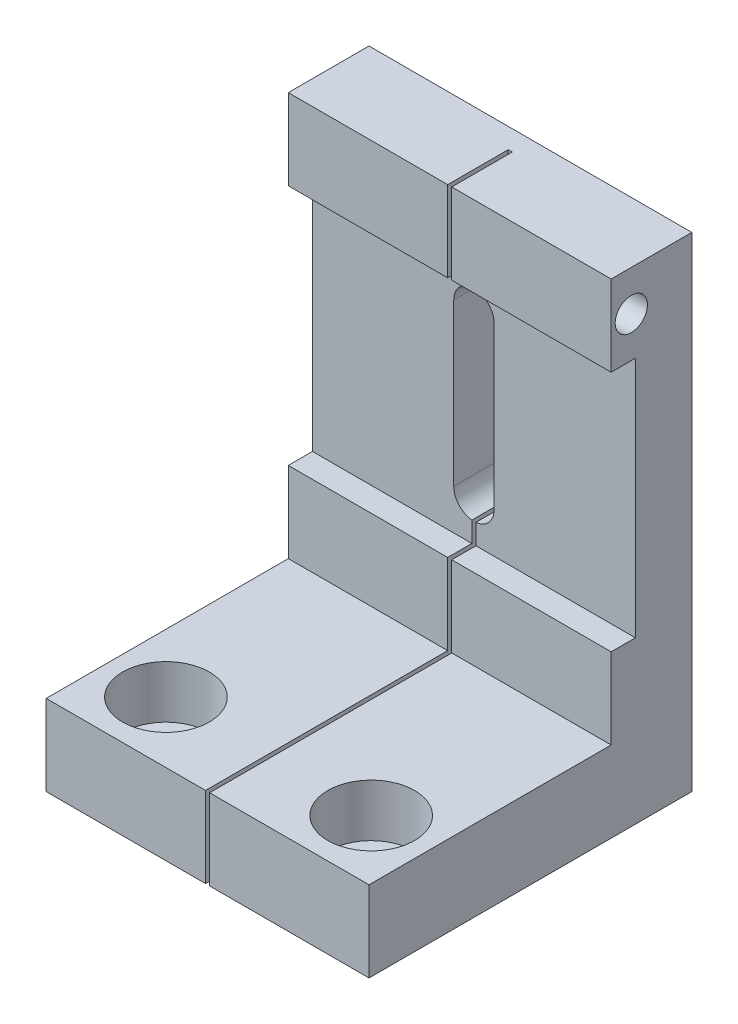
ISO-10303-21;
HEADER;
FILE_DESCRIPTION(('STEP AP214'),'2;1');
FILE_NAME('part.step','',(''),(''),'','','');
FILE_SCHEMA(('AUTOMOTIVE_DESIGN { 1 0 10303 214 1 1 1 1 }'));
ENDSEC;
DATA;
#1=APPLICATION_CONTEXT('core data for automotive mechanical design processes');
#2=APPLICATION_PROTOCOL_DEFINITION('international standard','automotive_design',2000,#1);
#3=PRODUCT_CONTEXT('',#1,'mechanical');
#4=PRODUCT('Part','Part','',(#3));
#5=PRODUCT_RELATED_PRODUCT_CATEGORY('part','',(#4));
#6=PRODUCT_DEFINITION_FORMATION('','',#4);
#7=PRODUCT_DEFINITION_CONTEXT('part definition',#1,'design');
#8=PRODUCT_DEFINITION('design','',#6,#7);
#9=PRODUCT_DEFINITION_SHAPE('','',#8);
#10=(LENGTH_UNIT() NAMED_UNIT(*) SI_UNIT(.MILLI.,.METRE.));
#11=(NAMED_UNIT(*) PLANE_ANGLE_UNIT() SI_UNIT($,.RADIAN.));
#12=(NAMED_UNIT(*) SI_UNIT($,.STERADIAN.) SOLID_ANGLE_UNIT());
#13=UNCERTAINTY_MEASURE_WITH_UNIT(LENGTH_MEASURE(1.E-05),#10,'distance_accuracy_value','');
#14=(GEOMETRIC_REPRESENTATION_CONTEXT(3) GLOBAL_UNCERTAINTY_ASSIGNED_CONTEXT((#13)) GLOBAL_UNIT_ASSIGNED_CONTEXT((#10,
#11,#12)) REPRESENTATION_CONTEXT('',''));
#15=CARTESIAN_POINT('',(0.,0.,0.));
#16=DIRECTION('',(0.,0.,1.));
#17=DIRECTION('',(1.,0.,0.));
#18=AXIS2_PLACEMENT_3D('',#15,#16,#17);
#19=CARTESIAN_POINT('',(-7.29999999999999,-40.383347775863,32.43));
#20=DIRECTION('',(0.,-1.,0.));
#21=DIRECTION('',(0.,0.,-1.));
#22=AXIS2_PLACEMENT_3D('',#19,#20,#21);
#23=CYLINDRICAL_SURFACE('',#22,3.4);
#24=CARTESIAN_POINT('',(-7.29999999999999,-60.,32.43));
#25=DIRECTION('',(0.,-1.,0.));
#26=DIRECTION('',(0.,0.,-1.));
#27=AXIS2_PLACEMENT_3D('',#24,#25,#26);
#28=CIRCLE('',#27,3.4);
#29=CARTESIAN_POINT('',(-7.29999999999999,-60.,29.03));
#30=VERTEX_POINT('',#29);
#31=EDGE_CURVE('E471',#30,#30,#28,.T.);
#32=ORIENTED_EDGE('',*,*,#31,.T.);
#33=EDGE_LOOP('',(#32));
#34=FACE_BOUND('',#33,.T.);
#35=CARTESIAN_POINT('',(-7.29999999999999,-56.5,32.43));
#36=DIRECTION('',(0.,1.,0.));
#37=DIRECTION('',(-1.,0.,0.));
#38=AXIS2_PLACEMENT_3D('',#35,#36,#37);
#39=CIRCLE('',#38,3.4);
#40=CARTESIAN_POINT('',(-10.7,-56.5,32.43));
#41=VERTEX_POINT('',#40);
#42=EDGE_CURVE('E41',#41,#41,#39,.F.);
#43=ORIENTED_EDGE('',*,*,#42,.F.);
#44=EDGE_LOOP('',(#43));
#45=FACE_BOUND('',#44,.T.);
#46=ADVANCED_FACE('F37',(#34,#45),#23,.F.);
#47=CARTESIAN_POINT('',(-32.73,-40.383347775863,32.43));
#48=DIRECTION('',(0.,-1.,0.));
#49=DIRECTION('',(0.,0.,-1.));
#50=AXIS2_PLACEMENT_3D('',#47,#48,#49);
#51=CYLINDRICAL_SURFACE('',#50,3.4);
#52=CARTESIAN_POINT('',(-32.73,-60.,32.43));
#53=DIRECTION('',(0.,-1.,0.));
#54=DIRECTION('',(0.,0.,-1.));
#55=AXIS2_PLACEMENT_3D('',#52,#53,#54);
#56=CIRCLE('',#55,3.4);
#57=CARTESIAN_POINT('',(-32.73,-60.,29.03));
#58=VERTEX_POINT('',#57);
#59=EDGE_CURVE('E462',#58,#58,#56,.T.);
#60=ORIENTED_EDGE('',*,*,#59,.T.);
#61=EDGE_LOOP('',(#60));
#62=FACE_BOUND('',#61,.T.);
#63=CARTESIAN_POINT('',(-32.73,-56.5,32.43));
#64=DIRECTION('',(0.,1.,0.));
#65=DIRECTION('',(-1.,0.,0.));
#66=AXIS2_PLACEMENT_3D('',#63,#64,#65);
#67=CIRCLE('',#66,3.4);
#68=CARTESIAN_POINT('',(-36.13,-56.5,32.43));
#69=VERTEX_POINT('',#68);
#70=EDGE_CURVE('E440',#69,#69,#67,.F.);
#71=ORIENTED_EDGE('',*,*,#70,.F.);
#72=EDGE_LOOP('',(#71));
#73=FACE_BOUND('',#72,.T.);
#74=ADVANCED_FACE('F585',(#62,#73),#51,.F.);
#75=CARTESIAN_POINT('',(0.,0.,10.));
#76=DIRECTION('',(0.,0.,-1.));
#77=DIRECTION('',(-1.,0.,0.));
#78=AXIS2_PLACEMENT_3D('',#75,#76,#77);
#79=PLANE('',#78);
#80=DIRECTION('',(1.,0.,0.));
#81=VECTOR('',#80,1.);
#82=CARTESIAN_POINT('',(-40.,-40.,10.));
#83=LINE('',#82,#81);
#84=CARTESIAN_POINT('',(-19.75,-40.,10.));
#85=VERTEX_POINT('',#84);
#86=CARTESIAN_POINT('',(0.,-40.,10.));
#87=VERTEX_POINT('',#86);
#88=EDGE_CURVE('E345',#85,#87,#83,.T.);
#89=ORIENTED_EDGE('',*,*,#88,.F.);
#90=DIRECTION('',(0.,-1.,0.));
#91=VECTOR('',#90,1.);
#92=CARTESIAN_POINT('',(-19.75,0.,10.));
#93=LINE('',#92,#91);
#94=CARTESIAN_POINT('',(-19.75,-50.,10.));
#95=VERTEX_POINT('',#94);
#96=EDGE_CURVE('E290',#85,#95,#93,.T.);
#97=ORIENTED_EDGE('',*,*,#96,.T.);
#98=DIRECTION('',(-1.,0.,0.));
#99=VECTOR('',#98,1.);
#100=CARTESIAN_POINT('',(0.,-50.,10.));
#101=LINE('',#100,#99);
#102=CARTESIAN_POINT('',(0.,-50.,10.));
#103=VERTEX_POINT('',#102);
#104=EDGE_CURVE('E315',#103,#95,#101,.T.);
#105=ORIENTED_EDGE('',*,*,#104,.F.);
#106=DIRECTION('',(0.,1.,0.));
#107=VECTOR('',#106,1.);
#108=CARTESIAN_POINT('',(0.,0.,10.));
#109=LINE('',#108,#107);
#110=EDGE_CURVE('E404',#103,#87,#109,.T.);
#111=ORIENTED_EDGE('',*,*,#110,.T.);
#112=EDGE_LOOP('',(#89,#97,#105,#111));
#113=FACE_BOUND('',#112,.T.);
#114=ADVANCED_FACE('F505',(#113),#79,.F.);
#115=DIRECTION('',(-1.,0.,0.));
#116=VECTOR('',#115,1.);
#117=CARTESIAN_POINT('',(0.,0.,10.));
#118=LINE('',#117,#116);
#119=CARTESIAN_POINT('',(0.,0.,10.));
#120=VERTEX_POINT('',#119);
#121=CARTESIAN_POINT('',(-19.75,0.,10.));
#122=VERTEX_POINT('',#121);
#123=EDGE_CURVE('E409',#120,#122,#118,.T.);
#124=ORIENTED_EDGE('',*,*,#123,.T.);
#125=DIRECTION('',(0.,-1.,0.));
#126=VECTOR('',#125,1.);
#127=CARTESIAN_POINT('',(-19.75,0.,10.));
#128=LINE('',#127,#126);
#129=CARTESIAN_POINT('',(-19.75,-10.,10.));
#130=VERTEX_POINT('',#129);
#131=EDGE_CURVE('E230',#122,#130,#128,.T.);
#132=ORIENTED_EDGE('',*,*,#131,.T.);
#133=DIRECTION('',(1.,0.,0.));
#134=VECTOR('',#133,1.);
#135=CARTESIAN_POINT('',(-40.,-10.,10.));
#136=LINE('',#135,#134);
#137=CARTESIAN_POINT('',(0.,-10.,10.));
#138=VERTEX_POINT('',#137);
#139=EDGE_CURVE('E357',#130,#138,#136,.T.);
#140=ORIENTED_EDGE('',*,*,#139,.T.);
#141=EDGE_CURVE('E408',#138,#120,#109,.T.);
#142=ORIENTED_EDGE('',*,*,#141,.T.);
#143=EDGE_LOOP('',(#124,#132,#140,#142));
#144=FACE_BOUND('',#143,.T.);
#145=ADVANCED_FACE('F538',(#144),#79,.F.);
#146=CARTESIAN_POINT('',(-40.,-10.,7.));
#147=DIRECTION('',(0.,0.,-1.));
#148=DIRECTION('',(0.,1.,0.));
#149=AXIS2_PLACEMENT_3D('',#146,#147,#148);
#150=PLANE('',#149);
#151=DIRECTION('',(1.,0.,0.));
#152=VECTOR('',#151,1.);
#153=CARTESIAN_POINT('',(-40.,-10.,7.));
#154=LINE('',#153,#152);
#155=CARTESIAN_POINT('',(-19.75,-10.,7.));
#156=VERTEX_POINT('',#155);
#157=CARTESIAN_POINT('',(0.,-10.,7.));
#158=VERTEX_POINT('',#157);
#159=EDGE_CURVE('E361',#156,#158,#154,.T.);
#160=ORIENTED_EDGE('',*,*,#159,.F.);
#161=DIRECTION('',(0.,-1.,0.));
#162=VECTOR('',#161,1.);
#163=CARTESIAN_POINT('',(-19.75,-10.,7.));
#164=LINE('',#163,#162);
#165=CARTESIAN_POINT('',(-19.75,-12.5125314072334,7.));
#166=VERTEX_POINT('',#165);
#167=EDGE_CURVE('E300',#156,#166,#164,.T.);
#168=ORIENTED_EDGE('',*,*,#167,.T.);
#169=CARTESIAN_POINT('',(-20.,-15.,7.));
#170=DIRECTION('',(0.,0.,-1.));
#171=DIRECTION('',(0.,1.,0.));
#172=AXIS2_PLACEMENT_3D('',#169,#170,#171);
#173=CIRCLE('',#172,2.5);
#174=CARTESIAN_POINT('',(-17.5,-15.,7.));
#175=VERTEX_POINT('',#174);
#176=EDGE_CURVE('E376',#175,#166,#173,.F.);
#177=ORIENTED_EDGE('',*,*,#176,.F.);
#178=DIRECTION('',(0.,1.,0.));
#179=VECTOR('',#178,1.);
#180=CARTESIAN_POINT('',(-17.5,-15.,7.));
#181=LINE('',#180,#179);
#182=CARTESIAN_POINT('',(-17.5,-35.,7.));
#183=VERTEX_POINT('',#182);
#184=EDGE_CURVE('E372',#183,#175,#181,.T.);
#185=ORIENTED_EDGE('',*,*,#184,.F.);
#186=CARTESIAN_POINT('',(-20.,-35.,7.));
#187=DIRECTION('',(0.,0.,-1.));
#188=DIRECTION('',(0.,1.,0.));
#189=AXIS2_PLACEMENT_3D('',#186,#187,#188);
#190=CIRCLE('',#189,2.5);
#191=CARTESIAN_POINT('',(-19.75,-37.4874685927665,7.));
#192=VERTEX_POINT('',#191);
#193=EDGE_CURVE('E356',#192,#183,#190,.F.);
#194=ORIENTED_EDGE('',*,*,#193,.F.);
#195=CARTESIAN_POINT('',(-19.75,-40.,7.));
#196=VERTEX_POINT('',#195);
#197=EDGE_CURVE('E296',#192,#196,#164,.T.);
#198=ORIENTED_EDGE('',*,*,#197,.T.);
#199=DIRECTION('',(1.,0.,0.));
#200=VECTOR('',#199,1.);
#201=CARTESIAN_POINT('',(-40.,-40.,7.));
#202=LINE('',#201,#200);
#203=CARTESIAN_POINT('',(0.,-40.,7.));
#204=VERTEX_POINT('',#203);
#205=EDGE_CURVE('E365',#196,#204,#202,.T.);
#206=ORIENTED_EDGE('',*,*,#205,.T.);
#207=DIRECTION('',(0.,1.,0.));
#208=VECTOR('',#207,1.);
#209=CARTESIAN_POINT('',(0.,-10.,7.));
#210=LINE('',#209,#208);
#211=EDGE_CURVE('E348',#204,#158,#210,.T.);
#212=ORIENTED_EDGE('',*,*,#211,.T.);
#213=EDGE_LOOP('',(#160,#168,#177,#185,#194,#198,#206,#212));
#214=FACE_BOUND('',#213,.T.);
#215=ADVANCED_FACE('F513',(#214),#150,.F.);
#216=CARTESIAN_POINT('',(-40.,-10.,7.));
#217=DIRECTION('',(0.,1.,0.));
#218=DIRECTION('',(-1.,0.,0.));
#219=AXIS2_PLACEMENT_3D('',#216,#217,#218);
#220=PLANE('',#219);
#221=ORIENTED_EDGE('',*,*,#139,.F.);
#222=DIRECTION('',(0.,0.,-1.));
#223=VECTOR('',#222,1.);
#224=CARTESIAN_POINT('',(-19.75,-10.,7.));
#225=LINE('',#224,#223);
#226=EDGE_CURVE('E303',#130,#156,#225,.T.);
#227=ORIENTED_EDGE('',*,*,#226,.T.);
#228=ORIENTED_EDGE('',*,*,#159,.T.);
#229=DIRECTION('',(0.,0.,1.));
#230=VECTOR('',#229,1.);
#231=CARTESIAN_POINT('',(0.,-10.,7.));
#232=LINE('',#231,#230);
#233=EDGE_CURVE('E339',#158,#138,#232,.T.);
#234=ORIENTED_EDGE('',*,*,#233,.T.);
#235=EDGE_LOOP('',(#221,#227,#228,#234));
#236=FACE_BOUND('',#235,.T.);
#237=ADVANCED_FACE('F541',(#236),#220,.F.);
#238=CARTESIAN_POINT('',(-40.,-40.,7.));
#239=DIRECTION('',(0.,-1.,0.));
#240=DIRECTION('',(1.,0.,0.));
#241=AXIS2_PLACEMENT_3D('',#238,#239,#240);
#242=PLANE('',#241);
#243=ORIENTED_EDGE('',*,*,#205,.F.);
#244=DIRECTION('',(0.,0.,1.));
#245=VECTOR('',#244,1.);
#246=CARTESIAN_POINT('',(-19.75,-40.,7.));
#247=LINE('',#246,#245);
#248=EDGE_CURVE('E293',#196,#85,#247,.T.);
#249=ORIENTED_EDGE('',*,*,#248,.T.);
#250=ORIENTED_EDGE('',*,*,#88,.T.);
#251=DIRECTION('',(0.,0.,-1.));
#252=VECTOR('',#251,1.);
#253=CARTESIAN_POINT('',(0.,-40.,7.));
#254=LINE('',#253,#252);
#255=EDGE_CURVE('E334',#87,#204,#254,.T.);
#256=ORIENTED_EDGE('',*,*,#255,.T.);
#257=EDGE_LOOP('',(#243,#249,#250,#256));
#258=FACE_BOUND('',#257,.T.);
#259=ADVANCED_FACE('F508',(#258),#242,.F.);
#260=CARTESIAN_POINT('',(0.,-50.,40.));
#261=DIRECTION('',(0.,-1.,0.));
#262=DIRECTION('',(1.,0.,0.));
#263=AXIS2_PLACEMENT_3D('',#260,#261,#262);
#264=PLANE('',#263);
#265=CARTESIAN_POINT('',(-7.29999999999999,-50.,32.43));
#266=DIRECTION('',(0.,1.,0.));
#267=DIRECTION('',(-1.,0.,0.));
#268=AXIS2_PLACEMENT_3D('',#265,#266,#267);
#269=CIRCLE('',#268,5.375);
#270=CARTESIAN_POINT('',(-12.675,-50.,32.43));
#271=VERTEX_POINT('',#270);
#272=EDGE_CURVE('E457',#271,#271,#269,.T.);
#273=ORIENTED_EDGE('',*,*,#272,.F.);
#274=EDGE_LOOP('',(#273));
#275=FACE_BOUND('',#274,.T.);
#276=ORIENTED_EDGE('',*,*,#104,.T.);
#277=DIRECTION('',(0.,0.,1.));
#278=VECTOR('',#277,1.);
#279=CARTESIAN_POINT('',(-19.75,-50.,40.));
#280=LINE('',#279,#278);
#281=CARTESIAN_POINT('',(-19.75,-50.,40.));
#282=VERTEX_POINT('',#281);
#283=EDGE_CURVE('E287',#95,#282,#280,.T.);
#284=ORIENTED_EDGE('',*,*,#283,.T.);
#285=DIRECTION('',(-1.,0.,0.));
#286=VECTOR('',#285,1.);
#287=CARTESIAN_POINT('',(0.,-50.,40.));
#288=LINE('',#287,#286);
#289=CARTESIAN_POINT('',(0.,-50.,40.));
#290=VERTEX_POINT('',#289);
#291=EDGE_CURVE('E316',#290,#282,#288,.T.);
#292=ORIENTED_EDGE('',*,*,#291,.F.);
#293=DIRECTION('',(0.,0.,-1.));
#294=VECTOR('',#293,1.);
#295=CARTESIAN_POINT('',(0.,-50.,40.));
#296=LINE('',#295,#294);
#297=EDGE_CURVE('E331',#290,#103,#296,.T.);
#298=ORIENTED_EDGE('',*,*,#297,.T.);
#299=EDGE_LOOP('',(#276,#284,#292,#298));
#300=FACE_BOUND('',#299,.T.);
#301=ADVANCED_FACE('F502',(#275,#300),#264,.F.);
#302=CARTESIAN_POINT('',(0.,0.,40.));
#303=DIRECTION('',(0.,0.,1.));
#304=DIRECTION('',(1.,0.,0.));
#305=AXIS2_PLACEMENT_3D('',#302,#303,#304);
#306=PLANE('',#305);
#307=DIRECTION('',(0.,1.,0.));
#308=VECTOR('',#307,1.);
#309=CARTESIAN_POINT('',(-19.75,-97.5033331851984,40.));
#310=LINE('',#309,#308);
#311=CARTESIAN_POINT('',(-19.75,-60.,40.));
#312=VERTEX_POINT('',#311);
#313=EDGE_CURVE('E254',#312,#282,#310,.T.);
#314=ORIENTED_EDGE('',*,*,#313,.F.);
#315=DIRECTION('',(1.,0.,0.));
#316=VECTOR('',#315,1.);
#317=CARTESIAN_POINT('',(0.,-60.,40.));
#318=LINE('',#317,#316);
#319=CARTESIAN_POINT('',(0.,-60.,40.));
#320=VERTEX_POINT('',#319);
#321=EDGE_CURVE('E322',#312,#320,#318,.T.);
#322=ORIENTED_EDGE('',*,*,#321,.T.);
#323=DIRECTION('',(0.,1.,0.));
#324=VECTOR('',#323,1.);
#325=CARTESIAN_POINT('',(0.,-60.,40.));
#326=LINE('',#325,#324);
#327=EDGE_CURVE('E311',#320,#290,#326,.T.);
#328=ORIENTED_EDGE('',*,*,#327,.T.);
#329=ORIENTED_EDGE('',*,*,#291,.T.);
#330=EDGE_LOOP('',(#314,#322,#328,#329));
#331=FACE_BOUND('',#330,.T.);
#332=ADVANCED_FACE('F490',(#331),#306,.T.);
#333=CARTESIAN_POINT('',(-20.25,-50.,10.));
#334=VERTEX_POINT('',#333);
#335=CARTESIAN_POINT('',(-40.,-50.,10.));
#336=VERTEX_POINT('',#335);
#337=EDGE_CURVE('E310',#334,#336,#101,.T.);
#338=ORIENTED_EDGE('',*,*,#337,.F.);
#339=DIRECTION('',(0.,1.,0.));
#340=VECTOR('',#339,1.);
#341=CARTESIAN_POINT('',(-20.25,0.,10.));
#342=LINE('',#341,#340);
#343=CARTESIAN_POINT('',(-20.25,-40.,10.));
#344=VERTEX_POINT('',#343);
#345=EDGE_CURVE('E268',#334,#344,#342,.T.);
#346=ORIENTED_EDGE('',*,*,#345,.T.);
#347=CARTESIAN_POINT('',(-40.,-40.,10.));
#348=VERTEX_POINT('',#347);
#349=EDGE_CURVE('E366',#348,#344,#83,.T.);
#350=ORIENTED_EDGE('',*,*,#349,.F.);
#351=DIRECTION('',(0.,-1.,0.));
#352=VECTOR('',#351,1.);
#353=CARTESIAN_POINT('',(-40.,0.,10.));
#354=LINE('',#353,#352);
#355=EDGE_CURVE('E411',#348,#336,#354,.T.);
#356=ORIENTED_EDGE('',*,*,#355,.T.);
#357=EDGE_LOOP('',(#338,#346,#350,#356));
#358=FACE_BOUND('',#357,.T.);
#359=ADVANCED_FACE('F567',(#358),#79,.F.);
#360=CARTESIAN_POINT('',(-40.,-10.,10.));
#361=VERTEX_POINT('',#360);
#362=CARTESIAN_POINT('',(-20.25,-10.,10.));
#363=VERTEX_POINT('',#362);
#364=EDGE_CURVE('E353',#361,#363,#136,.T.);
#365=ORIENTED_EDGE('',*,*,#364,.T.);
#366=DIRECTION('',(0.,1.,0.));
#367=VECTOR('',#366,1.);
#368=CARTESIAN_POINT('',(-20.25,0.,10.));
#369=LINE('',#368,#367);
#370=CARTESIAN_POINT('',(-20.25,0.,10.));
#371=VERTEX_POINT('',#370);
#372=EDGE_CURVE('E54',#363,#371,#369,.T.);
#373=ORIENTED_EDGE('',*,*,#372,.T.);
#374=CARTESIAN_POINT('',(-40.,0.,10.));
#375=VERTEX_POINT('',#374);
#376=EDGE_CURVE('E407',#371,#375,#118,.T.);
#377=ORIENTED_EDGE('',*,*,#376,.T.);
#378=EDGE_CURVE('E412',#375,#361,#354,.T.);
#379=ORIENTED_EDGE('',*,*,#378,.T.);
#380=EDGE_LOOP('',(#365,#373,#377,#379));
#381=FACE_BOUND('',#380,.T.);
#382=ADVANCED_FACE('F639',(#381),#79,.F.);
#383=CARTESIAN_POINT('',(0.,0.,10.));
#384=DIRECTION('',(-1.,0.,0.));
#385=DIRECTION('',(0.,-1.,0.));
#386=AXIS2_PLACEMENT_3D('',#383,#384,#385);
#387=PLANE('',#386);
#388=CARTESIAN_POINT('',(0.,-5.,7.5));
#389=DIRECTION('',(1.,0.,0.));
#390=DIRECTION('',(0.,1.,0.));
#391=AXIS2_PLACEMENT_3D('',#388,#389,#390);
#392=CIRCLE('',#391,2.);
#393=CARTESIAN_POINT('',(0.,-3.,7.5));
#394=VERTEX_POINT('',#393);
#395=EDGE_CURVE('E474',#394,#394,#392,.T.);
#396=ORIENTED_EDGE('',*,*,#395,.F.);
#397=EDGE_LOOP('',(#396));
#398=FACE_BOUND('',#397,.T.);
#399=ORIENTED_EDGE('',*,*,#141,.F.);
#400=ORIENTED_EDGE('',*,*,#233,.F.);
#401=ORIENTED_EDGE('',*,*,#211,.F.);
#402=ORIENTED_EDGE('',*,*,#255,.F.);
#403=ORIENTED_EDGE('',*,*,#110,.F.);
#404=ORIENTED_EDGE('',*,*,#297,.F.);
#405=ORIENTED_EDGE('',*,*,#327,.F.);
#406=DIRECTION('',(0.,0.,-1.));
#407=VECTOR('',#406,1.);
#408=CARTESIAN_POINT('',(0.,-60.,10.));
#409=LINE('',#408,#407);
#410=CARTESIAN_POINT('',(0.,-60.,0.));
#411=VERTEX_POINT('',#410);
#412=EDGE_CURVE('E415',#320,#411,#409,.T.);
#413=ORIENTED_EDGE('',*,*,#412,.T.);
#414=DIRECTION('',(0.,1.,0.));
#415=VECTOR('',#414,1.);
#416=CARTESIAN_POINT('',(0.,0.,0.));
#417=LINE('',#416,#415);
#418=CARTESIAN_POINT('',(0.,0.,0.));
#419=VERTEX_POINT('',#418);
#420=EDGE_CURVE('E395',#411,#419,#417,.T.);
#421=ORIENTED_EDGE('',*,*,#420,.T.);
#422=DIRECTION('',(0.,0.,-1.));
#423=VECTOR('',#422,1.);
#424=CARTESIAN_POINT('',(0.,0.,10.));
#425=LINE('',#424,#423);
#426=EDGE_CURVE('E432',#120,#419,#425,.T.);
#427=ORIENTED_EDGE('',*,*,#426,.F.);
#428=EDGE_LOOP('',(#399,#400,#401,#402,#403,#404,#405,#413,#421,#427));
#429=FACE_BOUND('',#428,.T.);
#430=ADVANCED_FACE('F39',(#398,#429),#387,.F.);
#431=CARTESIAN_POINT('',(0.,0.,10.));
#432=DIRECTION('',(0.,-1.,0.));
#433=DIRECTION('',(1.,0.,0.));
#434=AXIS2_PLACEMENT_3D('',#431,#432,#433);
#435=PLANE('',#434);
#436=DIRECTION('',(-1.,0.,0.));
#437=VECTOR('',#436,1.);
#438=CARTESIAN_POINT('',(-20.25,0.,2.5));
#439=LINE('',#438,#437);
#440=CARTESIAN_POINT('',(-19.75,0.,2.5));
#441=VERTEX_POINT('',#440);
#442=CARTESIAN_POINT('',(-20.25,0.,2.5));
#443=VERTEX_POINT('',#442);
#444=EDGE_CURVE('E235',#441,#443,#439,.T.);
#445=ORIENTED_EDGE('',*,*,#444,.F.);
#446=DIRECTION('',(0.,0.,-1.));
#447=VECTOR('',#446,1.);
#448=CARTESIAN_POINT('',(-19.75,0.,40.));
#449=LINE('',#448,#447);
#450=EDGE_CURVE('E224',#122,#441,#449,.T.);
#451=ORIENTED_EDGE('',*,*,#450,.F.);
#452=ORIENTED_EDGE('',*,*,#123,.F.);
#453=ORIENTED_EDGE('',*,*,#426,.T.);
#454=DIRECTION('',(-1.,0.,0.));
#455=VECTOR('',#454,1.);
#456=CARTESIAN_POINT('',(0.,0.,0.));
#457=LINE('',#456,#455);
#458=CARTESIAN_POINT('',(-40.,0.,0.));
#459=VERTEX_POINT('',#458);
#460=EDGE_CURVE('E418',#419,#459,#457,.T.);
#461=ORIENTED_EDGE('',*,*,#460,.T.);
#462=DIRECTION('',(0.,0.,-1.));
#463=VECTOR('',#462,1.);
#464=CARTESIAN_POINT('',(-40.,0.,10.));
#465=LINE('',#464,#463);
#466=EDGE_CURVE('E429',#375,#459,#465,.T.);
#467=ORIENTED_EDGE('',*,*,#466,.F.);
#468=ORIENTED_EDGE('',*,*,#376,.F.);
#469=DIRECTION('',(0.,0.,1.));
#470=VECTOR('',#469,1.);
#471=CARTESIAN_POINT('',(-20.25,0.,40.));
#472=LINE('',#471,#470);
#473=EDGE_CURVE('E246',#443,#371,#472,.T.);
#474=ORIENTED_EDGE('',*,*,#473,.F.);
#475=EDGE_LOOP('',(#445,#451,#452,#453,#461,#467,#468,#474));
#476=FACE_BOUND('',#475,.T.);
#477=ADVANCED_FACE('F248',(#476),#435,.F.);
#478=CARTESIAN_POINT('',(-40.,0.,10.));
#479=DIRECTION('',(1.,0.,0.));
#480=DIRECTION('',(0.,1.,0.));
#481=AXIS2_PLACEMENT_3D('',#478,#479,#480);
#482=PLANE('',#481);
#483=DIRECTION('',(0.,1.,0.));
#484=VECTOR('',#483,1.);
#485=CARTESIAN_POINT('',(-40.,-10.,7.));
#486=LINE('',#485,#484);
#487=CARTESIAN_POINT('',(-40.,-40.,7.));
#488=VERTEX_POINT('',#487);
#489=CARTESIAN_POINT('',(-40.,-10.,7.));
#490=VERTEX_POINT('',#489);
#491=EDGE_CURVE('E338',#488,#490,#486,.T.);
#492=ORIENTED_EDGE('',*,*,#491,.T.);
#493=DIRECTION('',(0.,0.,1.));
#494=VECTOR('',#493,1.);
#495=CARTESIAN_POINT('',(-40.,-10.,7.));
#496=LINE('',#495,#494);
#497=EDGE_CURVE('E342',#490,#361,#496,.T.);
#498=ORIENTED_EDGE('',*,*,#497,.T.);
#499=ORIENTED_EDGE('',*,*,#378,.F.);
#500=ORIENTED_EDGE('',*,*,#466,.T.);
#501=DIRECTION('',(0.,-1.,0.));
#502=VECTOR('',#501,1.);
#503=CARTESIAN_POINT('',(-40.,0.,0.));
#504=LINE('',#503,#502);
#505=CARTESIAN_POINT('',(-40.,-60.,0.));
#506=VERTEX_POINT('',#505);
#507=EDGE_CURVE('E420',#459,#506,#504,.T.);
#508=ORIENTED_EDGE('',*,*,#507,.T.);
#509=DIRECTION('',(0.,0.,-1.));
#510=VECTOR('',#509,1.);
#511=CARTESIAN_POINT('',(-40.,-60.,10.));
#512=LINE('',#511,#510);
#513=CARTESIAN_POINT('',(-40.,-60.,40.));
#514=VERTEX_POINT('',#513);
#515=EDGE_CURVE('E426',#514,#506,#512,.T.);
#516=ORIENTED_EDGE('',*,*,#515,.F.);
#517=DIRECTION('',(0.,-1.,0.));
#518=VECTOR('',#517,1.);
#519=CARTESIAN_POINT('',(-40.,-60.,40.));
#520=LINE('',#519,#518);
#521=CARTESIAN_POINT('',(-40.,-50.,40.));
#522=VERTEX_POINT('',#521);
#523=EDGE_CURVE('E319',#522,#514,#520,.T.);
#524=ORIENTED_EDGE('',*,*,#523,.F.);
#525=DIRECTION('',(0.,0.,-1.));
#526=VECTOR('',#525,1.);
#527=CARTESIAN_POINT('',(-40.,-50.,40.));
#528=LINE('',#527,#526);
#529=EDGE_CURVE('E326',#522,#336,#528,.T.);
#530=ORIENTED_EDGE('',*,*,#529,.T.);
#531=ORIENTED_EDGE('',*,*,#355,.F.);
#532=DIRECTION('',(0.,0.,-1.));
#533=VECTOR('',#532,1.);
#534=CARTESIAN_POINT('',(-40.,-40.,7.));
#535=LINE('',#534,#533);
#536=EDGE_CURVE('E335',#348,#488,#535,.T.);
#537=ORIENTED_EDGE('',*,*,#536,.T.);
#538=EDGE_LOOP('',(#492,#498,#499,#500,#508,#516,#524,#530,#531,#537));
#539=FACE_BOUND('',#538,.T.);
#540=ADVANCED_FACE('F529',(#539),#482,.F.);
#541=CARTESIAN_POINT('',(0.,-60.,10.));
#542=DIRECTION('',(0.,1.,0.));
#543=DIRECTION('',(0.,0.,1.));
#544=AXIS2_PLACEMENT_3D('',#541,#542,#543);
#545=PLANE('',#544);
#546=CARTESIAN_POINT('',(-7.3,-60.,6.99999999999999));
#547=DIRECTION('',(0.,-1.,0.));
#548=DIRECTION('',(0.,0.,-1.));
#549=AXIS2_PLACEMENT_3D('',#546,#547,#548);
#550=CIRCLE('',#549,2.49);
#551=CARTESIAN_POINT('',(-7.3,-60.,4.50999999999999));
#552=VERTEX_POINT('',#551);
#553=EDGE_CURVE('E442',#552,#552,#550,.T.);
#554=ORIENTED_EDGE('',*,*,#553,.F.);
#555=EDGE_LOOP('',(#554));
#556=FACE_BOUND('',#555,.T.);
#557=ORIENTED_EDGE('',*,*,#59,.F.);
#558=EDGE_LOOP('',(#557));
#559=FACE_BOUND('',#558,.T.);
#560=CARTESIAN_POINT('',(-32.73,-60.,7.));
#561=DIRECTION('',(0.,-1.,0.));
#562=DIRECTION('',(0.,0.,-1.));
#563=AXIS2_PLACEMENT_3D('',#560,#561,#562);
#564=CIRCLE('',#563,2.49);
#565=CARTESIAN_POINT('',(-32.73,-60.,4.51));
#566=VERTEX_POINT('',#565);
#567=EDGE_CURVE('E465',#566,#566,#564,.T.);
#568=ORIENTED_EDGE('',*,*,#567,.F.);
#569=EDGE_LOOP('',(#568));
#570=FACE_BOUND('',#569,.T.);
#571=ORIENTED_EDGE('',*,*,#31,.F.);
#572=EDGE_LOOP('',(#571));
#573=FACE_BOUND('',#572,.T.);
#574=ORIENTED_EDGE('',*,*,#321,.F.);
#575=DIRECTION('',(0.,0.,1.));
#576=VECTOR('',#575,1.);
#577=CARTESIAN_POINT('',(-19.75,-60.,40.));
#578=LINE('',#577,#576);
#579=CARTESIAN_POINT('',(-19.75,-60.,2.5));
#580=VERTEX_POINT('',#579);
#581=EDGE_CURVE('E266',#580,#312,#578,.T.);
#582=ORIENTED_EDGE('',*,*,#581,.F.);
#583=DIRECTION('',(1.,0.,0.));
#584=VECTOR('',#583,1.);
#585=CARTESIAN_POINT('',(-20.25,-60.,2.5));
#586=LINE('',#585,#584);
#587=CARTESIAN_POINT('',(-20.25,-60.,2.5));
#588=VERTEX_POINT('',#587);
#589=EDGE_CURVE('E264',#588,#580,#586,.T.);
#590=ORIENTED_EDGE('',*,*,#589,.F.);
#591=DIRECTION('',(0.,0.,-1.));
#592=VECTOR('',#591,1.);
#593=CARTESIAN_POINT('',(-20.25,-60.,40.));
#594=LINE('',#593,#592);
#595=CARTESIAN_POINT('',(-20.25,-60.,40.));
#596=VERTEX_POINT('',#595);
#597=EDGE_CURVE('E256',#596,#588,#594,.T.);
#598=ORIENTED_EDGE('',*,*,#597,.F.);
#599=EDGE_CURVE('E323',#514,#596,#318,.T.);
#600=ORIENTED_EDGE('',*,*,#599,.F.);
#601=ORIENTED_EDGE('',*,*,#515,.T.);
#602=DIRECTION('',(1.,0.,0.));
#603=VECTOR('',#602,1.);
#604=CARTESIAN_POINT('',(0.,-60.,0.));
#605=LINE('',#604,#603);
#606=EDGE_CURVE('E422',#506,#411,#605,.T.);
#607=ORIENTED_EDGE('',*,*,#606,.T.);
#608=ORIENTED_EDGE('',*,*,#412,.F.);
#609=EDGE_LOOP('',(#574,#582,#590,#598,#600,#601,#607,#608));
#610=FACE_BOUND('',#609,.T.);
#611=ADVANCED_FACE('F492',(#556,#559,#570,#573,#610),#545,.F.);
#612=CARTESIAN_POINT('',(0.,0.,0.));
#613=DIRECTION('',(0.,0.,-1.));
#614=DIRECTION('',(-1.,0.,0.));
#615=AXIS2_PLACEMENT_3D('',#612,#613,#614);
#616=PLANE('',#615);
#617=CARTESIAN_POINT('',(-20.,-15.,0.));
#618=DIRECTION('',(0.,0.,1.));
#619=DIRECTION('',(1.,0.,0.));
#620=AXIS2_PLACEMENT_3D('',#617,#618,#619);
#621=CIRCLE('',#620,2.5);
#622=CARTESIAN_POINT('',(-17.5,-15.,0.));
#623=VERTEX_POINT('',#622);
#624=CARTESIAN_POINT('',(-22.5,-15.,0.));
#625=VERTEX_POINT('',#624);
#626=EDGE_CURVE('E379',#623,#625,#621,.T.);
#627=ORIENTED_EDGE('',*,*,#626,.T.);
#628=DIRECTION('',(0.,-1.,0.));
#629=VECTOR('',#628,1.);
#630=CARTESIAN_POINT('',(-22.5,-15.,0.));
#631=LINE('',#630,#629);
#632=CARTESIAN_POINT('',(-22.5,-35.,0.));
#633=VERTEX_POINT('',#632);
#634=EDGE_CURVE('E382',#625,#633,#631,.T.);
#635=ORIENTED_EDGE('',*,*,#634,.T.);
#636=CARTESIAN_POINT('',(-20.,-35.,0.));
#637=DIRECTION('',(0.,0.,1.));
#638=DIRECTION('',(1.,0.,0.));
#639=AXIS2_PLACEMENT_3D('',#636,#637,#638);
#640=CIRCLE('',#639,2.5);
#641=CARTESIAN_POINT('',(-17.5,-35.,0.));
#642=VERTEX_POINT('',#641);
#643=EDGE_CURVE('E385',#633,#642,#640,.T.);
#644=ORIENTED_EDGE('',*,*,#643,.T.);
#645=DIRECTION('',(0.,1.,0.));
#646=VECTOR('',#645,1.);
#647=CARTESIAN_POINT('',(-17.5,-15.,0.));
#648=LINE('',#647,#646);
#649=EDGE_CURVE('E388',#642,#623,#648,.T.);
#650=ORIENTED_EDGE('',*,*,#649,.T.);
#651=EDGE_LOOP('',(#627,#635,#644,#650));
#652=FACE_BOUND('',#651,.T.);
#653=ORIENTED_EDGE('',*,*,#420,.F.);
#654=ORIENTED_EDGE('',*,*,#606,.F.);
#655=ORIENTED_EDGE('',*,*,#507,.F.);
#656=ORIENTED_EDGE('',*,*,#460,.F.);
#657=EDGE_LOOP('',(#653,#654,#655,#656));
#658=FACE_BOUND('',#657,.T.);
#659=ADVANCED_FACE('F533',(#652,#658),#616,.T.);
#660=CARTESIAN_POINT('',(-20.,-15.,0.));
#661=DIRECTION('',(0.,0.,1.));
#662=DIRECTION('',(1.,0.,0.));
#663=AXIS2_PLACEMENT_3D('',#660,#661,#662);
#664=CYLINDRICAL_SURFACE('',#663,2.5);
#665=ORIENTED_EDGE('',*,*,#176,.T.);
#666=DIRECTION('',(0.,0.,1.));
#667=VECTOR('',#666,1.);
#668=CARTESIAN_POINT('',(-19.75,-12.5125314072334,0.));
#669=LINE('',#668,#667);
#670=CARTESIAN_POINT('',(-19.75,-12.5125314072334,2.5));
#671=VERTEX_POINT('',#670);
#672=EDGE_CURVE('E306',#166,#671,#669,.F.);
#673=ORIENTED_EDGE('',*,*,#672,.T.);
#674=CARTESIAN_POINT('',(-20.,-15.,2.5));
#675=DIRECTION('',(0.,0.,-1.));
#676=DIRECTION('',(-1.,0.,0.));
#677=AXIS2_PLACEMENT_3D('',#674,#675,#676);
#678=CIRCLE('',#677,2.5);
#679=CARTESIAN_POINT('',(-20.25,-12.5125314072334,2.5));
#680=VERTEX_POINT('',#679);
#681=EDGE_CURVE('E244',#671,#680,#678,.F.);
#682=ORIENTED_EDGE('',*,*,#681,.T.);
#683=DIRECTION('',(0.,0.,1.));
#684=VECTOR('',#683,1.);
#685=CARTESIAN_POINT('',(-20.25,-12.5125314072334,0.));
#686=LINE('',#685,#684);
#687=CARTESIAN_POINT('',(-20.25,-12.5125314072334,7.));
#688=VERTEX_POINT('',#687);
#689=EDGE_CURVE('E283',#680,#688,#686,.T.);
#690=ORIENTED_EDGE('',*,*,#689,.T.);
#691=CARTESIAN_POINT('',(-22.5,-15.,7.));
#692=VERTEX_POINT('',#691);
#693=EDGE_CURVE('E375',#688,#692,#173,.F.);
#694=ORIENTED_EDGE('',*,*,#693,.T.);
#695=DIRECTION('',(0.,0.,1.));
#696=VECTOR('',#695,1.);
#697=CARTESIAN_POINT('',(-22.5,-15.,0.));
#698=LINE('',#697,#696);
#699=EDGE_CURVE('E391',#625,#692,#698,.T.);
#700=ORIENTED_EDGE('',*,*,#699,.F.);
#701=ORIENTED_EDGE('',*,*,#626,.F.);
#702=DIRECTION('',(0.,0.,1.));
#703=VECTOR('',#702,1.);
#704=CARTESIAN_POINT('',(-17.5,-15.,0.));
#705=LINE('',#704,#703);
#706=EDGE_CURVE('E392',#623,#175,#705,.T.);
#707=ORIENTED_EDGE('',*,*,#706,.T.);
#708=EDGE_LOOP('',(#665,#673,#682,#690,#694,#700,#701,#707));
#709=FACE_BOUND('',#708,.T.);
#710=ADVANCED_FACE('F544',(#709),#664,.F.);
#711=CARTESIAN_POINT('',(-17.5,-15.,0.));
#712=DIRECTION('',(1.,0.,0.));
#713=DIRECTION('',(0.,0.,-1.));
#714=AXIS2_PLACEMENT_3D('',#711,#712,#713);
#715=PLANE('',#714);
#716=DIRECTION('',(0.,0.,1.));
#717=VECTOR('',#716,1.);
#718=CARTESIAN_POINT('',(-17.5,-35.,0.));
#719=LINE('',#718,#717);
#720=EDGE_CURVE('E396',#642,#183,#719,.T.);
#721=ORIENTED_EDGE('',*,*,#720,.T.);
#722=ORIENTED_EDGE('',*,*,#184,.T.);
#723=ORIENTED_EDGE('',*,*,#706,.F.);
#724=ORIENTED_EDGE('',*,*,#649,.F.);
#725=EDGE_LOOP('',(#721,#722,#723,#724));
#726=FACE_BOUND('',#725,.T.);
#727=ADVANCED_FACE('F547',(#726),#715,.F.);
#728=CARTESIAN_POINT('',(-20.,-35.,0.));
#729=DIRECTION('',(0.,0.,1.));
#730=DIRECTION('',(1.,0.,0.));
#731=AXIS2_PLACEMENT_3D('',#728,#729,#730);
#732=CYLINDRICAL_SURFACE('',#731,2.5);
#733=CARTESIAN_POINT('',(-20.,-35.,2.5));
#734=DIRECTION('',(0.,0.,-1.));
#735=DIRECTION('',(-1.,0.,0.));
#736=AXIS2_PLACEMENT_3D('',#733,#734,#735);
#737=CIRCLE('',#736,2.5);
#738=CARTESIAN_POINT('',(-20.25,-37.4874685927665,2.5));
#739=VERTEX_POINT('',#738);
#740=CARTESIAN_POINT('',(-19.75,-37.4874685927665,2.5));
#741=VERTEX_POINT('',#740);
#742=EDGE_CURVE('E11',#739,#741,#737,.F.);
#743=ORIENTED_EDGE('',*,*,#742,.T.);
#744=DIRECTION('',(0.,0.,1.));
#745=VECTOR('',#744,1.);
#746=CARTESIAN_POINT('',(-19.75,-37.4874685927665,0.));
#747=LINE('',#746,#745);
#748=EDGE_CURVE('E299',#741,#192,#747,.T.);
#749=ORIENTED_EDGE('',*,*,#748,.T.);
#750=ORIENTED_EDGE('',*,*,#193,.T.);
#751=ORIENTED_EDGE('',*,*,#720,.F.);
#752=ORIENTED_EDGE('',*,*,#643,.F.);
#753=DIRECTION('',(0.,0.,1.));
#754=VECTOR('',#753,1.);
#755=CARTESIAN_POINT('',(-22.5,-35.,0.));
#756=LINE('',#755,#754);
#757=CARTESIAN_POINT('',(-22.5,-35.,7.));
#758=VERTEX_POINT('',#757);
#759=EDGE_CURVE('E399',#633,#758,#756,.T.);
#760=ORIENTED_EDGE('',*,*,#759,.T.);
#761=CARTESIAN_POINT('',(-20.25,-37.4874685927665,7.));
#762=VERTEX_POINT('',#761);
#763=EDGE_CURVE('E369',#758,#762,#190,.F.);
#764=ORIENTED_EDGE('',*,*,#763,.T.);
#765=DIRECTION('',(0.,0.,1.));
#766=VECTOR('',#765,1.);
#767=CARTESIAN_POINT('',(-20.25,-37.4874685927665,0.));
#768=LINE('',#767,#766);
#769=EDGE_CURVE('E277',#762,#739,#768,.F.);
#770=ORIENTED_EDGE('',*,*,#769,.T.);
#771=EDGE_LOOP('',(#743,#749,#750,#751,#752,#760,#764,#770));
#772=FACE_BOUND('',#771,.T.);
#773=ADVANCED_FACE('F516',(#772),#732,.F.);
#774=CARTESIAN_POINT('',(-22.5,-15.,0.));
#775=DIRECTION('',(-1.,0.,0.));
#776=DIRECTION('',(0.,0.,1.));
#777=AXIS2_PLACEMENT_3D('',#774,#775,#776);
#778=PLANE('',#777);
#779=ORIENTED_EDGE('',*,*,#699,.T.);
#780=DIRECTION('',(0.,-1.,0.));
#781=VECTOR('',#780,1.);
#782=CARTESIAN_POINT('',(-22.5,-15.,7.));
#783=LINE('',#782,#781);
#784=EDGE_CURVE('E46',#692,#758,#783,.T.);
#785=ORIENTED_EDGE('',*,*,#784,.T.);
#786=ORIENTED_EDGE('',*,*,#759,.F.);
#787=ORIENTED_EDGE('',*,*,#634,.F.);
#788=EDGE_LOOP('',(#779,#785,#786,#787));
#789=FACE_BOUND('',#788,.T.);
#790=ADVANCED_FACE('F552',(#789),#778,.F.);
#791=CARTESIAN_POINT('',(-20.25,-40.,7.));
#792=VERTEX_POINT('',#791);
#793=EDGE_CURVE('E362',#488,#792,#202,.T.);
#794=ORIENTED_EDGE('',*,*,#793,.T.);
#795=DIRECTION('',(0.,1.,0.));
#796=VECTOR('',#795,1.);
#797=CARTESIAN_POINT('',(-20.25,-10.,7.));
#798=LINE('',#797,#796);
#799=EDGE_CURVE('E274',#792,#762,#798,.T.);
#800=ORIENTED_EDGE('',*,*,#799,.T.);
#801=ORIENTED_EDGE('',*,*,#763,.F.);
#802=ORIENTED_EDGE('',*,*,#784,.F.);
#803=ORIENTED_EDGE('',*,*,#693,.F.);
#804=CARTESIAN_POINT('',(-20.25,-10.,7.));
#805=VERTEX_POINT('',#804);
#806=EDGE_CURVE('E278',#688,#805,#798,.T.);
#807=ORIENTED_EDGE('',*,*,#806,.T.);
#808=EDGE_CURVE('E358',#490,#805,#154,.T.);
#809=ORIENTED_EDGE('',*,*,#808,.F.);
#810=ORIENTED_EDGE('',*,*,#491,.F.);
#811=EDGE_LOOP('',(#794,#800,#801,#802,#803,#807,#809,#810));
#812=FACE_BOUND('',#811,.T.);
#813=ADVANCED_FACE('F556',(#812),#150,.F.);
#814=ORIENTED_EDGE('',*,*,#808,.T.);
#815=DIRECTION('',(0.,0.,1.));
#816=VECTOR('',#815,1.);
#817=CARTESIAN_POINT('',(-20.25,-10.,7.));
#818=LINE('',#817,#816);
#819=EDGE_CURVE('E281',#805,#363,#818,.T.);
#820=ORIENTED_EDGE('',*,*,#819,.T.);
#821=ORIENTED_EDGE('',*,*,#364,.F.);
#822=ORIENTED_EDGE('',*,*,#497,.F.);
#823=EDGE_LOOP('',(#814,#820,#821,#822));
#824=FACE_BOUND('',#823,.T.);
#825=ADVANCED_FACE('F578',(#824),#220,.F.);
#826=ORIENTED_EDGE('',*,*,#349,.T.);
#827=DIRECTION('',(0.,0.,-1.));
#828=VECTOR('',#827,1.);
#829=CARTESIAN_POINT('',(-20.25,-40.,7.));
#830=LINE('',#829,#828);
#831=EDGE_CURVE('E271',#344,#792,#830,.T.);
#832=ORIENTED_EDGE('',*,*,#831,.T.);
#833=ORIENTED_EDGE('',*,*,#793,.F.);
#834=ORIENTED_EDGE('',*,*,#536,.F.);
#835=EDGE_LOOP('',(#826,#832,#833,#834));
#836=FACE_BOUND('',#835,.T.);
#837=ADVANCED_FACE('F560',(#836),#242,.F.);
#838=CARTESIAN_POINT('',(-32.73,-50.,32.43));
#839=DIRECTION('',(0.,1.,0.));
#840=DIRECTION('',(-1.,0.,0.));
#841=AXIS2_PLACEMENT_3D('',#838,#839,#840);
#842=CIRCLE('',#841,5.375);
#843=CARTESIAN_POINT('',(-38.105,-50.,32.43));
#844=VERTEX_POINT('',#843);
#845=EDGE_CURVE('E450',#844,#844,#842,.T.);
#846=ORIENTED_EDGE('',*,*,#845,.F.);
#847=EDGE_LOOP('',(#846));
#848=FACE_BOUND('',#847,.T.);
#849=CARTESIAN_POINT('',(-20.25,-50.,40.));
#850=VERTEX_POINT('',#849);
#851=EDGE_CURVE('E314',#850,#522,#288,.T.);
#852=ORIENTED_EDGE('',*,*,#851,.F.);
#853=DIRECTION('',(0.,0.,-1.));
#854=VECTOR('',#853,1.);
#855=CARTESIAN_POINT('',(-20.25,-50.,40.));
#856=LINE('',#855,#854);
#857=EDGE_CURVE('E62',#850,#334,#856,.T.);
#858=ORIENTED_EDGE('',*,*,#857,.T.);
#859=ORIENTED_EDGE('',*,*,#337,.T.);
#860=ORIENTED_EDGE('',*,*,#529,.F.);
#861=EDGE_LOOP('',(#852,#858,#859,#860));
#862=FACE_BOUND('',#861,.T.);
#863=ADVANCED_FACE('F569',(#848,#862),#264,.F.);
#864=DIRECTION('',(0.,1.,0.));
#865=VECTOR('',#864,1.);
#866=CARTESIAN_POINT('',(-20.25,-97.5033331851984,40.));
#867=LINE('',#866,#865);
#868=EDGE_CURVE('E257',#596,#850,#867,.T.);
#869=ORIENTED_EDGE('',*,*,#868,.T.);
#870=ORIENTED_EDGE('',*,*,#851,.T.);
#871=ORIENTED_EDGE('',*,*,#523,.T.);
#872=ORIENTED_EDGE('',*,*,#599,.T.);
#873=EDGE_LOOP('',(#869,#870,#871,#872));
#874=FACE_BOUND('',#873,.T.);
#875=ADVANCED_FACE('F524',(#874),#306,.T.);
#876=CARTESIAN_POINT('',(-19.75,-97.5033331851984,40.));
#877=DIRECTION('',(1.,0.,0.));
#878=DIRECTION('',(0.,1.,0.));
#879=AXIS2_PLACEMENT_3D('',#876,#877,#878);
#880=PLANE('',#879);
#881=DIRECTION('',(0.,1.,0.));
#882=VECTOR('',#881,1.);
#883=CARTESIAN_POINT('',(-19.75,-97.5033331851984,2.5));
#884=LINE('',#883,#882);
#885=EDGE_CURVE('E245',#580,#741,#884,.T.);
#886=ORIENTED_EDGE('',*,*,#885,.F.);
#887=ORIENTED_EDGE('',*,*,#581,.T.);
#888=ORIENTED_EDGE('',*,*,#313,.T.);
#889=ORIENTED_EDGE('',*,*,#283,.F.);
#890=ORIENTED_EDGE('',*,*,#96,.F.);
#891=ORIENTED_EDGE('',*,*,#248,.F.);
#892=ORIENTED_EDGE('',*,*,#197,.F.);
#893=ORIENTED_EDGE('',*,*,#748,.F.);
#894=EDGE_LOOP('',(#886,#887,#888,#889,#890,#891,#892,#893));
#895=FACE_BOUND('',#894,.T.);
#896=ADVANCED_FACE('F485',(#895),#880,.F.);
#897=CARTESIAN_POINT('',(-20.25,-97.5033331851984,40.));
#898=DIRECTION('',(-1.,0.,0.));
#899=DIRECTION('',(0.,-1.,0.));
#900=AXIS2_PLACEMENT_3D('',#897,#898,#899);
#901=PLANE('',#900);
#902=ORIENTED_EDGE('',*,*,#799,.F.);
#903=ORIENTED_EDGE('',*,*,#831,.F.);
#904=ORIENTED_EDGE('',*,*,#345,.F.);
#905=ORIENTED_EDGE('',*,*,#857,.F.);
#906=ORIENTED_EDGE('',*,*,#868,.F.);
#907=ORIENTED_EDGE('',*,*,#597,.T.);
#908=DIRECTION('',(0.,1.,0.));
#909=VECTOR('',#908,1.);
#910=CARTESIAN_POINT('',(-20.25,-97.5033331851984,2.5));
#911=LINE('',#910,#909);
#912=EDGE_CURVE('E259',#588,#739,#911,.T.);
#913=ORIENTED_EDGE('',*,*,#912,.T.);
#914=ORIENTED_EDGE('',*,*,#769,.F.);
#915=EDGE_LOOP('',(#902,#903,#904,#905,#906,#907,#913,#914));
#916=FACE_BOUND('',#915,.T.);
#917=ADVANCED_FACE('F558',(#916),#901,.F.);
#918=CARTESIAN_POINT('',(-20.25,-97.5033331851984,2.5));
#919=DIRECTION('',(0.,0.,-1.));
#920=DIRECTION('',(-1.,0.,0.));
#921=AXIS2_PLACEMENT_3D('',#918,#919,#920);
#922=PLANE('',#921);
#923=ORIENTED_EDGE('',*,*,#912,.F.);
#924=ORIENTED_EDGE('',*,*,#589,.T.);
#925=ORIENTED_EDGE('',*,*,#885,.T.);
#926=ORIENTED_EDGE('',*,*,#742,.F.);
#927=EDGE_LOOP('',(#923,#924,#925,#926));
#928=FACE_BOUND('',#927,.T.);
#929=ADVANCED_FACE('F520',(#928),#922,.F.);
#930=EDGE_CURVE('E227',#671,#441,#884,.T.);
#931=ORIENTED_EDGE('',*,*,#930,.T.);
#932=ORIENTED_EDGE('',*,*,#444,.T.);
#933=EDGE_CURVE('E261',#680,#443,#911,.T.);
#934=ORIENTED_EDGE('',*,*,#933,.F.);
#935=ORIENTED_EDGE('',*,*,#681,.F.);
#936=EDGE_LOOP('',(#931,#932,#934,#935));
#937=FACE_BOUND('',#936,.T.);
#938=ADVANCED_FACE('F240',(#937),#922,.F.);
#939=CARTESIAN_POINT('',(-19.75,-5.,7.5));
#940=DIRECTION('',(1.,0.,0.));
#941=DIRECTION('',(0.,1.,0.));
#942=AXIS2_PLACEMENT_3D('',#939,#940,#941);
#943=CIRCLE('',#942,2.);
#944=CARTESIAN_POINT('',(-19.75,-3.,7.5));
#945=VERTEX_POINT('',#944);
#946=EDGE_CURVE('E236',#945,#945,#943,.T.);
#947=ORIENTED_EDGE('',*,*,#946,.T.);
#948=EDGE_LOOP('',(#947));
#949=FACE_BOUND('',#948,.T.);
#950=ORIENTED_EDGE('',*,*,#450,.T.);
#951=ORIENTED_EDGE('',*,*,#930,.F.);
#952=ORIENTED_EDGE('',*,*,#672,.F.);
#953=ORIENTED_EDGE('',*,*,#167,.F.);
#954=ORIENTED_EDGE('',*,*,#226,.F.);
#955=ORIENTED_EDGE('',*,*,#131,.F.);
#956=EDGE_LOOP('',(#950,#951,#952,#953,#954,#955));
#957=FACE_BOUND('',#956,.T.);
#958=ADVANCED_FACE('F226',(#949,#957),#880,.F.);
#959=CARTESIAN_POINT('',(-20.25,-5.,7.5));
#960=DIRECTION('',(-1.,0.,0.));
#961=DIRECTION('',(0.,-1.,0.));
#962=AXIS2_PLACEMENT_3D('',#959,#960,#961);
#963=CIRCLE('',#962,2.);
#964=CARTESIAN_POINT('',(-20.25,-7.,7.5));
#965=VERTEX_POINT('',#964);
#966=EDGE_CURVE('E437',#965,#965,#963,.T.);
#967=ORIENTED_EDGE('',*,*,#966,.T.);
#968=EDGE_LOOP('',(#967));
#969=FACE_BOUND('',#968,.T.);
#970=ORIENTED_EDGE('',*,*,#819,.F.);
#971=ORIENTED_EDGE('',*,*,#806,.F.);
#972=ORIENTED_EDGE('',*,*,#689,.F.);
#973=ORIENTED_EDGE('',*,*,#933,.T.);
#974=ORIENTED_EDGE('',*,*,#473,.T.);
#975=ORIENTED_EDGE('',*,*,#372,.F.);
#976=EDGE_LOOP('',(#970,#971,#972,#973,#974,#975));
#977=FACE_BOUND('',#976,.T.);
#978=ADVANCED_FACE('F602',(#969,#977),#901,.F.);
#979=CARTESIAN_POINT('',(-30.,-5.,7.5));
#980=DIRECTION('',(1.,0.,0.));
#981=DIRECTION('',(0.,1.,0.));
#982=AXIS2_PLACEMENT_3D('',#979,#980,#981);
#983=PLANE('',#982);
#984=CARTESIAN_POINT('',(-30.,-5.,7.5));
#985=DIRECTION('',(1.,0.,0.));
#986=DIRECTION('',(0.,1.,0.));
#987=AXIS2_PLACEMENT_3D('',#984,#985,#986);
#988=CIRCLE('',#987,2.);
#989=CARTESIAN_POINT('',(-30.,-3.,7.5));
#990=VERTEX_POINT('',#989);
#991=EDGE_CURVE('E439',#990,#990,#988,.T.);
#992=ORIENTED_EDGE('',*,*,#991,.T.);
#993=EDGE_LOOP('',(#992));
#994=FACE_BOUND('',#993,.T.);
#995=ADVANCED_FACE('F598',(#994),#983,.T.);
#996=CARTESIAN_POINT('',(-30.,-5.,7.5));
#997=DIRECTION('',(1.,0.,0.));
#998=DIRECTION('',(0.,1.,0.));
#999=AXIS2_PLACEMENT_3D('',#996,#997,#998);
#1000=CYLINDRICAL_SURFACE('',#999,2.);
#1001=ORIENTED_EDGE('',*,*,#991,.F.);
#1002=EDGE_LOOP('',(#1001));
#1003=FACE_BOUND('',#1002,.T.);
#1004=ORIENTED_EDGE('',*,*,#966,.F.);
#1005=EDGE_LOOP('',(#1004));
#1006=FACE_BOUND('',#1005,.T.);
#1007=ADVANCED_FACE('F601',(#1003,#1006),#1000,.F.);
#1008=ORIENTED_EDGE('',*,*,#395,.T.);
#1009=EDGE_LOOP('',(#1008));
#1010=FACE_BOUND('',#1009,.T.);
#1011=ORIENTED_EDGE('',*,*,#946,.F.);
#1012=EDGE_LOOP('',(#1011));
#1013=FACE_BOUND('',#1012,.T.);
#1014=ADVANCED_FACE('F604',(#1010,#1013),#1000,.F.);
#1015=CARTESIAN_POINT('',(-32.73,-40.383347775863,7.));
#1016=DIRECTION('',(0.,-1.,0.));
#1017=DIRECTION('',(0.,0.,-1.));
#1018=AXIS2_PLACEMENT_3D('',#1015,#1016,#1017);
#1019=CYLINDRICAL_SURFACE('',#1018,2.49);
#1020=CARTESIAN_POINT('',(-32.73,-50.,7.));
#1021=DIRECTION('',(0.,-1.,0.));
#1022=DIRECTION('',(1.,0.,0.));
#1023=AXIS2_PLACEMENT_3D('',#1020,#1021,#1022);
#1024=CIRCLE('',#1023,2.49);
#1025=CARTESIAN_POINT('',(-30.24,-50.,7.));
#1026=VERTEX_POINT('',#1025);
#1027=EDGE_CURVE('E468',#1026,#1026,#1024,.F.);
#1028=ORIENTED_EDGE('',*,*,#1027,.T.);
#1029=EDGE_LOOP('',(#1028));
#1030=FACE_BOUND('',#1029,.T.);
#1031=ORIENTED_EDGE('',*,*,#567,.T.);
#1032=EDGE_LOOP('',(#1031));
#1033=FACE_BOUND('',#1032,.T.);
#1034=ADVANCED_FACE('F596',(#1030,#1033),#1019,.F.);
#1035=CARTESIAN_POINT('',(0.,-50.,40.));
#1036=DIRECTION('',(0.,-1.,0.));
#1037=DIRECTION('',(1.,0.,0.));
#1038=AXIS2_PLACEMENT_3D('',#1035,#1036,#1037);
#1039=PLANE('',#1038);
#1040=ORIENTED_EDGE('',*,*,#1027,.F.);
#1041=EDGE_LOOP('',(#1040));
#1042=FACE_BOUND('',#1041,.T.);
#1043=ADVANCED_FACE('F696',(#1042),#1039,.T.);
#1044=CARTESIAN_POINT('',(-7.3,-40.383347775863,6.99999999999999));
#1045=DIRECTION('',(0.,-1.,0.));
#1046=DIRECTION('',(0.,0.,-1.));
#1047=AXIS2_PLACEMENT_3D('',#1044,#1045,#1046);
#1048=CYLINDRICAL_SURFACE('',#1047,2.49);
#1049=CARTESIAN_POINT('',(-7.3,-50.,6.99999999999999));
#1050=DIRECTION('',(0.,-1.,0.));
#1051=DIRECTION('',(1.,0.,0.));
#1052=AXIS2_PLACEMENT_3D('',#1049,#1050,#1051);
#1053=CIRCLE('',#1052,2.49);
#1054=CARTESIAN_POINT('',(-4.81,-50.,6.99999999999999));
#1055=VERTEX_POINT('',#1054);
#1056=EDGE_CURVE('E447',#1055,#1055,#1053,.F.);
#1057=ORIENTED_EDGE('',*,*,#1056,.T.);
#1058=EDGE_LOOP('',(#1057));
#1059=FACE_BOUND('',#1058,.T.);
#1060=ORIENTED_EDGE('',*,*,#553,.T.);
#1061=EDGE_LOOP('',(#1060));
#1062=FACE_BOUND('',#1061,.T.);
#1063=ADVANCED_FACE('F705',(#1059,#1062),#1048,.F.);
#1064=CARTESIAN_POINT('',(0.,-50.,40.));
#1065=DIRECTION('',(0.,-1.,0.));
#1066=DIRECTION('',(1.,0.,0.));
#1067=AXIS2_PLACEMENT_3D('',#1064,#1065,#1066);
#1068=PLANE('',#1067);
#1069=ORIENTED_EDGE('',*,*,#1056,.F.);
#1070=EDGE_LOOP('',(#1069));
#1071=FACE_BOUND('',#1070,.T.);
#1072=ADVANCED_FACE('F714',(#1071),#1068,.T.);
#1073=CARTESIAN_POINT('',(-32.73,-56.5,32.43));
#1074=DIRECTION('',(0.,1.,0.));
#1075=DIRECTION('',(-1.,0.,0.));
#1076=AXIS2_PLACEMENT_3D('',#1073,#1074,#1075);
#1077=PLANE('',#1076);
#1078=CARTESIAN_POINT('',(-32.73,-56.5,32.43));
#1079=DIRECTION('',(0.,1.,0.));
#1080=DIRECTION('',(-1.,0.,0.));
#1081=AXIS2_PLACEMENT_3D('',#1078,#1079,#1080);
#1082=CIRCLE('',#1081,5.375);
#1083=CARTESIAN_POINT('',(-38.105,-56.5,32.43));
#1084=VERTEX_POINT('',#1083);
#1085=EDGE_CURVE('E443',#1084,#1084,#1082,.T.);
#1086=ORIENTED_EDGE('',*,*,#1085,.T.);
#1087=EDGE_LOOP('',(#1086));
#1088=FACE_BOUND('',#1087,.T.);
#1089=ORIENTED_EDGE('',*,*,#70,.T.);
#1090=EDGE_LOOP('',(#1089));
#1091=FACE_BOUND('',#1090,.T.);
#1092=ADVANCED_FACE('F723',(#1088,#1091),#1077,.T.);
#1093=CARTESIAN_POINT('',(-32.73,-56.5,32.43));
#1094=DIRECTION('',(0.,1.,0.));
#1095=DIRECTION('',(-1.,0.,0.));
#1096=AXIS2_PLACEMENT_3D('',#1093,#1094,#1095);
#1097=CYLINDRICAL_SURFACE('',#1096,5.375);
#1098=ORIENTED_EDGE('',*,*,#1085,.F.);
#1099=EDGE_LOOP('',(#1098));
#1100=FACE_BOUND('',#1099,.T.);
#1101=ORIENTED_EDGE('',*,*,#845,.T.);
#1102=EDGE_LOOP('',(#1101));
#1103=FACE_BOUND('',#1102,.T.);
#1104=ADVANCED_FACE('F759',(#1100,#1103),#1097,.F.);
#1105=CARTESIAN_POINT('',(-7.29999999999999,-56.5,32.43));
#1106=DIRECTION('',(0.,1.,0.));
#1107=DIRECTION('',(-1.,0.,0.));
#1108=AXIS2_PLACEMENT_3D('',#1105,#1106,#1107);
#1109=PLANE('',#1108);
#1110=CARTESIAN_POINT('',(-7.29999999999999,-56.5,32.43));
#1111=DIRECTION('',(0.,1.,0.));
#1112=DIRECTION('',(-1.,0.,0.));
#1113=AXIS2_PLACEMENT_3D('',#1110,#1111,#1112);
#1114=CIRCLE('',#1113,5.375);
#1115=CARTESIAN_POINT('',(-12.675,-56.5,32.43));
#1116=VERTEX_POINT('',#1115);
#1117=EDGE_CURVE('E795',#1116,#1116,#1114,.T.);
#1118=ORIENTED_EDGE('',*,*,#1117,.T.);
#1119=EDGE_LOOP('',(#1118));
#1120=FACE_BOUND('',#1119,.T.);
#1121=ORIENTED_EDGE('',*,*,#42,.T.);
#1122=EDGE_LOOP('',(#1121));
#1123=FACE_BOUND('',#1122,.T.);
#1124=ADVANCED_FACE('F768',(#1120,#1123),#1109,.T.);
#1125=CARTESIAN_POINT('',(-7.29999999999999,-56.5,32.43));
#1126=DIRECTION('',(0.,1.,0.));
#1127=DIRECTION('',(-1.,0.,0.));
#1128=AXIS2_PLACEMENT_3D('',#1125,#1126,#1127);
#1129=CYLINDRICAL_SURFACE('',#1128,5.375);
#1130=ORIENTED_EDGE('',*,*,#1117,.F.);
#1131=EDGE_LOOP('',(#1130));
#1132=FACE_BOUND('',#1131,.T.);
#1133=ORIENTED_EDGE('',*,*,#272,.T.);
#1134=EDGE_LOOP('',(#1133));
#1135=FACE_BOUND('',#1134,.T.);
#1136=ADVANCED_FACE('F778',(#1132,#1135),#1129,.F.);
#1137=CLOSED_SHELL('',(#46,#74,#114,#145,#215,#237,#259,#301,#332,#359,#382,#430,#477,#540,#611,
#659,#710,#727,#773,#790,#813,#825,#837,#863,#875,#896,#917,#929,#938,#958,#978,#995,#1007,
#1014,#1034,#1043,#1063,#1072,#1092,#1104,#1124,#1136));
#1138=MANIFOLD_SOLID_BREP('B2',#1137);
#1139=ADVANCED_BREP_SHAPE_REPRESENTATION('',(#18,#1138),#14);
#1140=SHAPE_DEFINITION_REPRESENTATION(#9,#1139);
ENDSEC;
END-ISO-10303-21;
